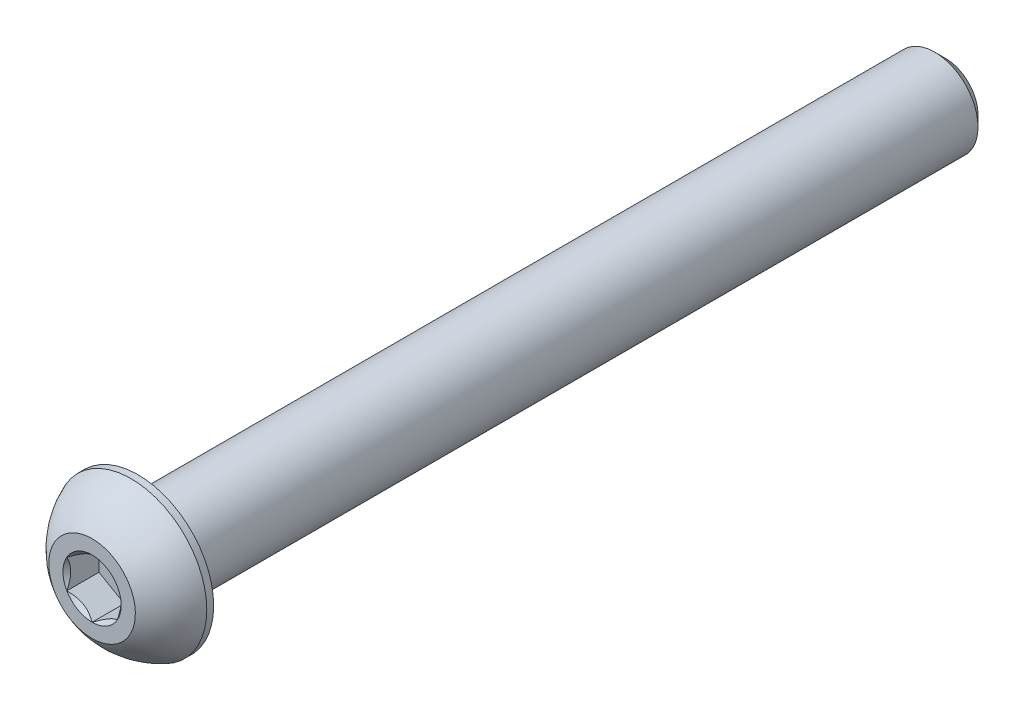
ISO-10303-21;
HEADER;
FILE_DESCRIPTION(('STEP AP214'),'2;1');
FILE_NAME('part.step','',(''),(''),'','','');
FILE_SCHEMA(('AUTOMOTIVE_DESIGN { 1 0 10303 214 1 1 1 1 }'));
ENDSEC;
DATA;
#1=APPLICATION_CONTEXT('core data for automotive mechanical design processes');
#2=APPLICATION_PROTOCOL_DEFINITION('international standard','automotive_design',2000,#1);
#3=PRODUCT_CONTEXT('',#1,'mechanical');
#4=PRODUCT('Part','Part','',(#3));
#5=PRODUCT_RELATED_PRODUCT_CATEGORY('part','',(#4));
#6=PRODUCT_DEFINITION_FORMATION('','',#4);
#7=PRODUCT_DEFINITION_CONTEXT('part definition',#1,'design');
#8=PRODUCT_DEFINITION('design','',#6,#7);
#9=PRODUCT_DEFINITION_SHAPE('','',#8);
#10=(LENGTH_UNIT() NAMED_UNIT(*) SI_UNIT(.MILLI.,.METRE.));
#11=(NAMED_UNIT(*) PLANE_ANGLE_UNIT() SI_UNIT($,.RADIAN.));
#12=(NAMED_UNIT(*) SI_UNIT($,.STERADIAN.) SOLID_ANGLE_UNIT());
#13=UNCERTAINTY_MEASURE_WITH_UNIT(LENGTH_MEASURE(1.E-05),#10,'distance_accuracy_value','');
#14=(GEOMETRIC_REPRESENTATION_CONTEXT(3) GLOBAL_UNCERTAINTY_ASSIGNED_CONTEXT((#13)) GLOBAL_UNIT_ASSIGNED_CONTEXT((#10,
#11,#12)) REPRESENTATION_CONTEXT('',''));
#15=CARTESIAN_POINT('',(0.,0.,0.));
#16=DIRECTION('',(0.,0.,1.));
#17=DIRECTION('',(1.,0.,0.));
#18=AXIS2_PLACEMENT_3D('',#15,#16,#17);
#19=CARTESIAN_POINT('',(-2.22044604925031E-13,-4.7625,-93.9546));
#20=DIRECTION('',(0.,0.,-1.));
#21=DIRECTION('',(0.,1.,0.));
#22=AXIS2_PLACEMENT_3D('',#19,#20,#21);
#23=PLANE('',#22);
#24=CARTESIAN_POINT('',(0.,0.,-93.9546));
#25=DIRECTION('',(0.,0.,-1.));
#26=DIRECTION('',(0.,1.,0.));
#27=AXIS2_PLACEMENT_3D('',#24,#25,#26);
#28=CIRCLE('',#27,3.57187500000002);
#29=CARTESIAN_POINT('',(0.,-3.57187500000001,-93.9546));
#30=VERTEX_POINT('',#29);
#31=EDGE_CURVE('E176',#30,#30,#28,.T.);
#32=ORIENTED_EDGE('',*,*,#31,.T.);
#33=EDGE_LOOP('',(#32));
#34=FACE_BOUND('',#33,.T.);
#35=ADVANCED_FACE('F36',(#34),#23,.T.);
#36=CARTESIAN_POINT('',(0.,0.,-93.9546));
#37=DIRECTION('',(0.,0.,-1.));
#38=DIRECTION('',(0.,1.,0.));
#39=AXIS2_PLACEMENT_3D('',#36,#37,#38);
#40=CYLINDRICAL_SURFACE('',#39,4.7625);
#41=CARTESIAN_POINT('',(0.,0.,-92.763975));
#42=DIRECTION('',(0.,0.,-1.));
#43=DIRECTION('',(0.,1.,0.));
#44=AXIS2_PLACEMENT_3D('',#41,#42,#43);
#45=CIRCLE('',#44,4.7625);
#46=CARTESIAN_POINT('',(0.,-4.76250000000001,-92.763975));
#47=VERTEX_POINT('',#46);
#48=EDGE_CURVE('E50',#47,#47,#45,.F.);
#49=ORIENTED_EDGE('',*,*,#48,.T.);
#50=EDGE_LOOP('',(#49));
#51=FACE_BOUND('',#50,.T.);
#52=CARTESIAN_POINT('',(-2.22044604925031E-13,0.,-5.05460000000002));
#53=DIRECTION('',(0.,0.,1.));
#54=DIRECTION('',(1.,0.,0.));
#55=AXIS2_PLACEMENT_3D('',#52,#53,#54);
#56=CIRCLE('',#55,4.7625);
#57=CARTESIAN_POINT('',(4.76249999999978,0.,-5.05460000000002));
#58=VERTEX_POINT('',#57);
#59=EDGE_CURVE('E173',#58,#58,#56,.F.);
#60=ORIENTED_EDGE('',*,*,#59,.T.);
#61=EDGE_LOOP('',(#60));
#62=FACE_BOUND('',#61,.T.);
#63=ADVANCED_FACE('F181',(#51,#62),#40,.T.);
#64=CARTESIAN_POINT('',(0.,0.,-93.9546));
#65=DIRECTION('',(0.,0.,1.));
#66=DIRECTION('',(0.,-1.,0.));
#67=AXIS2_PLACEMENT_3D('',#64,#65,#66);
#68=CONICAL_SURFACE('',#67,3.57187500000002,0.785398163397448);
#69=CARTESIAN_POINT('',(0.,-4.76250000000001,-92.763975));
#70=CARTESIAN_POINT('',(0.,-4.75009765625001,-92.77637734375));
#71=CARTESIAN_POINT('',(0.,-4.73769531250001,-92.7887796875));
#72=CARTESIAN_POINT('',(0.,-4.71289062500001,-92.813584375));
#73=CARTESIAN_POINT('',(0.,-4.70048828125001,-92.82598671875));
#74=CARTESIAN_POINT('',(0.,-4.67568359375001,-92.85079140625));
#75=CARTESIAN_POINT('',(0.,-4.66328125000001,-92.86319375));
#76=CARTESIAN_POINT('',(0.,-4.63847656250001,-92.8879984375));
#77=CARTESIAN_POINT('',(0.,-4.62607421875001,-92.90040078125));
#78=CARTESIAN_POINT('',(0.,-4.60126953125001,-92.92520546875));
#79=CARTESIAN_POINT('',(0.,-4.58886718750001,-92.9376078125));
#80=CARTESIAN_POINT('',(0.,-4.56406250000001,-92.9624125));
#81=CARTESIAN_POINT('',(0.,-4.55166015625001,-92.97481484375));
#82=CARTESIAN_POINT('',(0.,-4.52685546875001,-92.99961953125));
#83=CARTESIAN_POINT('',(0.,-4.51445312500001,-93.012021875));
#84=CARTESIAN_POINT('',(0.,-4.48964843750001,-93.0368265625));
#85=CARTESIAN_POINT('',(0.,-4.47724609375001,-93.04922890625));
#86=CARTESIAN_POINT('',(0.,-4.45244140625001,-93.07403359375));
#87=CARTESIAN_POINT('',(0.,-4.44003906250001,-93.0864359375));
#88=CARTESIAN_POINT('',(0.,-4.41523437500001,-93.111240625));
#89=CARTESIAN_POINT('',(0.,-4.40283203125001,-93.12364296875));
#90=CARTESIAN_POINT('',(0.,-4.37802734375001,-93.14844765625));
#91=CARTESIAN_POINT('',(0.,-4.36562500000001,-93.16085));
#92=CARTESIAN_POINT('',(0.,-4.34082031250001,-93.1856546875));
#93=CARTESIAN_POINT('',(0.,-4.32841796875001,-93.19805703125));
#94=CARTESIAN_POINT('',(0.,-4.30361328125001,-93.22286171875));
#95=CARTESIAN_POINT('',(0.,-4.29121093750001,-93.2352640625));
#96=CARTESIAN_POINT('',(0.,-4.26640625000001,-93.26006875));
#97=CARTESIAN_POINT('',(0.,-4.25400390625001,-93.27247109375));
#98=CARTESIAN_POINT('',(0.,-4.22919921875001,-93.29727578125));
#99=CARTESIAN_POINT('',(0.,-4.21679687500001,-93.309678125));
#100=CARTESIAN_POINT('',(0.,-4.19199218750001,-93.3344828125));
#101=CARTESIAN_POINT('',(0.,-4.17958984375001,-93.34688515625));
#102=CARTESIAN_POINT('',(0.,-4.15478515625001,-93.37168984375));
#103=CARTESIAN_POINT('',(0.,-4.14238281250001,-93.3840921875));
#104=CARTESIAN_POINT('',(0.,-4.11757812500001,-93.408896875));
#105=CARTESIAN_POINT('',(0.,-4.10517578125001,-93.42129921875));
#106=CARTESIAN_POINT('',(0.,-4.08037109375001,-93.44610390625));
#107=CARTESIAN_POINT('',(0.,-4.06796875000001,-93.45850625));
#108=CARTESIAN_POINT('',(0.,-4.04316406250001,-93.4833109375));
#109=CARTESIAN_POINT('',(0.,-4.03076171875001,-93.49571328125));
#110=CARTESIAN_POINT('',(0.,-4.00595703125001,-93.52051796875));
#111=CARTESIAN_POINT('',(0.,-3.99355468750001,-93.5329203125));
#112=CARTESIAN_POINT('',(0.,-3.96875000000001,-93.557725));
#113=CARTESIAN_POINT('',(0.,-3.95634765625001,-93.57012734375));
#114=CARTESIAN_POINT('',(0.,-3.93154296875001,-93.59493203125));
#115=CARTESIAN_POINT('',(0.,-3.91914062500001,-93.607334375));
#116=CARTESIAN_POINT('',(0.,-3.89433593750001,-93.6321390625));
#117=CARTESIAN_POINT('',(0.,-3.88193359375001,-93.64454140625));
#118=CARTESIAN_POINT('',(0.,-3.85712890625001,-93.66934609375));
#119=CARTESIAN_POINT('',(0.,-3.84472656250001,-93.6817484375));
#120=CARTESIAN_POINT('',(0.,-3.81992187500001,-93.706553125));
#121=CARTESIAN_POINT('',(0.,-3.80751953125001,-93.71895546875));
#122=CARTESIAN_POINT('',(0.,-3.78271484375001,-93.74376015625));
#123=CARTESIAN_POINT('',(0.,-3.77031250000001,-93.7561625));
#124=CARTESIAN_POINT('',(0.,-3.74550781250001,-93.7809671875));
#125=CARTESIAN_POINT('',(0.,-3.73310546875001,-93.79336953125));
#126=CARTESIAN_POINT('',(0.,-3.70830078125001,-93.81817421875));
#127=CARTESIAN_POINT('',(0.,-3.69589843750001,-93.8305765625));
#128=CARTESIAN_POINT('',(0.,-3.67109375000001,-93.85538125));
#129=CARTESIAN_POINT('',(0.,-3.65869140625001,-93.86778359375));
#130=CARTESIAN_POINT('',(0.,-3.63388671875001,-93.89258828125));
#131=CARTESIAN_POINT('',(0.,-3.62148437500001,-93.904990625));
#132=CARTESIAN_POINT('',(0.,-3.59667968750001,-93.9297953125));
#133=CARTESIAN_POINT('',(0.,-3.58427734375001,-93.94219765625));
#134=CARTESIAN_POINT('',(0.,-3.57187500000001,-93.9546));
#135=B_SPLINE_CURVE_WITH_KNOTS('',3,(#69,#70,#71,#72,#73,#74,#75,#76,#77,#78,#79,#80,#81,#82,
#83,#84,#85,#86,#87,#88,#89,#90,#91,#92,#93,#94,#95,#96,#97,#98,#99,#100,#101,#102,#103,#104,
#105,#106,#107,#108,#109,#110,#111,#112,#113,#114,#115,#116,#117,#118,#119,#120,#121,#122,#123,
#124,#125,#126,#127,#128,#129,#130,#131,#132,#133,#134),.UNSPECIFIED.,.F.,.F.,(4,2,2,2,2,2,2,2,
2,2,2,2,2,2,2,2,2,2,2,2,2,2,2,2,2,2,2,2,2,2,2,2,4),(0.,0.0526186882093896,0.105237376418779,
0.157856064628169,0.210474752837558,0.263093441046948,0.315712129256338,0.368330817465727,
0.420949505675117,0.473568193884506,0.526186882093896,0.578805570303285,0.631424258512675,
0.684042946722064,0.736661634931454,0.789280323140843,0.841899011350233,0.894517699559623,
0.947136387769012,0.999755075978402,1.05237376418779,1.10499245239718,1.15761114060657,
1.21022982881596,1.26284851702535,1.31546720523474,1.36808589344413,1.42070458165352,
1.47332326986291,1.5259419580723,1.57856064628169,1.63117933449108,1.68379802270046),.UNSPECIFIED.);
#136=EDGE_CURVE('BSEAM38',#47,#30,#135,.T.);
#137=ORIENTED_EDGE('',*,*,#48,.F.);
#138=ORIENTED_EDGE('',*,*,#31,.F.);
#139=ORIENTED_EDGE('',*,*,#136,.T.);
#140=ORIENTED_EDGE('',*,*,#136,.F.);
#141=EDGE_LOOP('',(#137,#139,#138,#140));
#142=FACE_BOUND('',#141,.T.);
#143=ADVANCED_FACE('F38',(#142),#68,.T.);
#144=CARTESIAN_POINT('',(0.,0.,-7.58617381466153));
#145=DIRECTION('',(0.,0.,1.));
#146=DIRECTION('',(0.,-1.,0.));
#147=AXIS2_PLACEMENT_3D('',#144,#145,#146);
#148=SPHERICAL_SURFACE('',#147,8.9572004217979);
#149=CARTESIAN_POINT('',(0.,0.,0.));
#150=DIRECTION('',(0.,0.,1.));
#151=DIRECTION('',(1.,0.,0.));
#152=AXIS2_PLACEMENT_3D('',#149,#150,#151);
#153=CIRCLE('',#152,4.7625);
#154=CARTESIAN_POINT('',(0.,-4.76249999999999,0.));
#155=VERTEX_POINT('',#154);
#156=EDGE_CURVE('E170',#155,#155,#153,.T.);
#157=CARTESIAN_POINT('',(-2.22044604925031E-13,1.11022302462516E-13,-4.29641000000003));
#158=DIRECTION('',(0.,0.,1.));
#159=DIRECTION('',(1.,0.,0.));
#160=AXIS2_PLACEMENT_3D('',#157,#158,#159);
#161=CIRCLE('',#160,8.3312);
#162=CARTESIAN_POINT('',(0.,-8.33119999999999,-4.29641000000003));
#163=VERTEX_POINT('',#162);
#164=EDGE_CURVE('E164',#163,#163,#161,.T.);
#165=CARTESIAN_POINT('',(0.,-4.76249999999999,0.));
#166=CARTESIAN_POINT('',(0.,-4.81260964553359,-0.0314580778612506));
#167=CARTESIAN_POINT('',(0.,-4.86240751258114,-0.0634127815227664));
#168=CARTESIAN_POINT('',(0.,-4.96136033481777,-0.128302589266068));
#169=CARTESIAN_POINT('',(0.,-5.01051529000685,-0.161237693347853));
#170=CARTESIAN_POINT('',(0.,-5.10816293364022,-0.228075450751433));
#171=CARTESIAN_POINT('',(0.,-5.1566556220845,-0.261978104073228));
#172=CARTESIAN_POINT('',(0.,-5.2529597050362,-0.330737625699055));
#173=CARTESIAN_POINT('',(0.,-5.30077109954361,-0.365594494003088));
#174=CARTESIAN_POINT('',(0.,-5.39569381682617,-0.436248764286399));
#175=CARTESIAN_POINT('',(0.,-5.44280513960131,-0.472046166265677));
#176=CARTESIAN_POINT('',(0.,-5.53630921537568,-0.544567445869759));
#177=CARTESIAN_POINT('',(0.,-5.58270196837493,-0.581291323494563));
#178=CARTESIAN_POINT('',(0.,-5.67475068741133,-0.655651134547841));
#179=CARTESIAN_POINT('',(0.,-5.72040665344849,-0.693287067976315));
#180=CARTESIAN_POINT('',(0.,-5.81096387103531,-0.769456212128977));
#181=CARTESIAN_POINT('',(0.,-5.85586512258496,-0.807989422853164));
#182=CARTESIAN_POINT('',(0.,-5.94489527992949,-0.885937990900432));
#183=CARTESIAN_POINT('',(0.,-5.98902418572437,-0.925353348223513));
#184=CARTESIAN_POINT('',(0.,-6.07649232359194,-1.00505073234356));
#185=CARTESIAN_POINT('',(0.,-6.11983155566463,-1.04533275914052));
#186=CARTESIAN_POINT('',(0.,-6.20570332819268,-1.12674766478091));
#187=CARTESIAN_POINT('',(0.,-6.24823586864803,-1.16788054362433));
#188=CARTESIAN_POINT('',(0.,-6.33247755680934,-1.25098100182578));
#189=CARTESIAN_POINT('',(0.,-6.3741867045153,-1.29294858118381));
#190=CARTESIAN_POINT('',(0.,-6.4567652293646,-1.37770196112389));
#191=CARTESIAN_POINT('',(0.,-6.49763460650793,-1.42048776170594));
#192=CARTESIAN_POINT('',(0.,-6.57851754216922,-1.50686078351465));
#193=CARTESIAN_POINT('',(0.,-6.61853110068717,-1.5504480047413));
#194=CARTESIAN_POINT('',(0.,-6.69768668708676,-1.63840675256829));
#195=CARTESIAN_POINT('',(0.,-6.73682871496841,-1.68277827916862));
#196=CARTESIAN_POINT('',(0.,-6.81422587030594,-1.77228821450102));
#197=CARTESIAN_POINT('',(0.,-6.85248099776184,-1.8174266232331));
#198=CARTESIAN_POINT('',(0.,-6.92808933071513,-1.90845259845764));
#199=CARTESIAN_POINT('',(0.,-6.96544253621252,-1.95434016495011));
#200=CARTESIAN_POINT('',(0.,-7.03923235787118,-2.04684643715442));
#201=CARTESIAN_POINT('',(0.,-7.07566897403246,-2.09346514286626));
#202=CARTESIAN_POINT('',(0.,-7.14761130955581,-2.18741538787392));
#203=CARTESIAN_POINT('',(0.,-7.1831170289179,-2.23474692716974));
#204=CARTESIAN_POINT('',(0.,-7.25318362891244,-2.33010425380361));
#205=CARTESIAN_POINT('',(0.,-7.28774450954489,-2.37813004114167));
#206=CARTESIAN_POINT('',(0.,-7.35590786115682,-2.47485700570989));
#207=CARTESIAN_POINT('',(0.,-7.3895103321363,-2.52355818294005));
#208=CARTESIAN_POINT('',(0.,-7.45574366985515,-2.62161680393882));
#209=CARTESIAN_POINT('',(0.,-7.48837453659453,-2.67097424770742));
#210=CARTESIAN_POINT('',(0.,-7.55265185276235,-2.7703260207354));
#211=CARTESIAN_POINT('',(0.,-7.58429830219079,-2.82032034999478));
#212=CARTESIAN_POINT('',(0.,-7.64659435721727,-2.92092626287139));
#213=CARTESIAN_POINT('',(0.,-7.67724396281532,-2.97153784648862));
#214=CARTESIAN_POINT('',(0.,-7.73753429507813,-3.07335839457716));
#215=CARTESIAN_POINT('',(0.,-7.76717502174289,-3.12456735904847));
#216=CARTESIAN_POINT('',(0.,-7.825435957232,-3.22756256075199));
#217=CARTESIAN_POINT('',(0.,-7.85405616605635,-3.2793487979842));
#218=CARTESIAN_POINT('',(0.,-7.91026482752416,-3.38347821050592));
#219=CARTESIAN_POINT('',(0.,-7.93785328016762,-3.43582138579544));
#220=CARTESIAN_POINT('',(0.,-7.99198759665663,-3.54104412079174));
#221=CARTESIAN_POINT('',(0.,-8.01853346050219,-3.59392368049851));
#222=CARTESIAN_POINT('',(0.,-8.07057217397927,-3.70019842098383));
#223=CARTESIAN_POINT('',(0.,-8.09606502361079,-3.75359360176237));
#224=CARTESIAN_POINT('',(0.,-8.14598770489916,-3.86087861516294));
#225=CARTESIAN_POINT('',(0.,-8.17041753655602,-3.91476844778496));
#226=CARTESIAN_POINT('',(0.,-8.21820456505067,-4.02302161415685));
#227=CARTESIAN_POINT('',(0.,-8.24156176188846,-4.07738494790672));
#228=CARTESIAN_POINT('',(0.,-8.28719443890176,-4.1865637323209));
#229=CARTESIAN_POINT('',(0.,-8.30946991907726,-4.2413791829852));
#230=CARTESIAN_POINT('',(0.,-8.33119999999999,-4.29641000000003));
#231=B_SPLINE_CURVE_WITH_KNOTS('',3,(#165,#166,#167,#168,#169,#170,#171,#172,#173,#174,#175,
#176,#177,#178,#179,#180,#181,#182,#183,#184,#185,#186,#187,#188,#189,#190,#191,#192,#193,#194,
#195,#196,#197,#198,#199,#200,#201,#202,#203,#204,#205,#206,#207,#208,#209,#210,#211,#212,#213,
#214,#215,#216,#217,#218,#219,#220,#221,#222,#223,#224,#225,#226,#227,#228,#229,#230),
.UNSPECIFIED.,.F.,.F.,(4,2,2,2,2,2,2,2,2,2,2,2,2,2,2,2,2,2,2,2,2,2,2,2,2,2,2,2,2,2,2,2,4),(0.,
0.177494373175661,0.354988746351323,0.532483119526984,0.709977492702646,0.887471865878307,
1.06496623905397,1.24246061222963,1.41995498540529,1.59744935858095,1.77494373175662,
1.95243810493228,2.12993247810794,2.3074268512836,2.48492122445926,2.66241559763492,
2.83990997081058,3.01740434398625,3.19489871716191,3.37239309033757,3.54988746351323,
3.72738183668889,3.90487620986455,4.08237058304022,4.25986495621588,4.43735932939154,
4.6148537025672,4.79234807574286,4.96984244891852,5.14733682209418,5.32483119526984,
5.5023255684455,5.67981994162117),.UNSPECIFIED.);
#232=EDGE_CURVE('BSEAM186',#155,#163,#231,.T.);
#233=ORIENTED_EDGE('',*,*,#156,.F.);
#234=ORIENTED_EDGE('',*,*,#164,.T.);
#235=ORIENTED_EDGE('',*,*,#232,.T.);
#236=ORIENTED_EDGE('',*,*,#232,.F.);
#237=EDGE_LOOP('',(#233,#235,#234,#236));
#238=FACE_BOUND('',#237,.T.);
#239=ADVANCED_FACE('F186',(#238),#148,.T.);
#240=CARTESIAN_POINT('',(0.,-4.76249999999989,1.11022302462516E-13));
#241=DIRECTION('',(0.,0.,-1.));
#242=DIRECTION('',(-1.,0.,0.));
#243=AXIS2_PLACEMENT_3D('',#240,#241,#242);
#244=PLANE('',#243);
#245=CARTESIAN_POINT('',(0.,0.,0.));
#246=DIRECTION('',(0.,0.,1.));
#247=DIRECTION('',(1.,0.,0.));
#248=AXIS2_PLACEMENT_3D('',#245,#246,#247);
#249=CIRCLE('',#248,3.20790243318486);
#250=CARTESIAN_POINT('',(-2.77812499999985,1.60395121659251,0.));
#251=VERTEX_POINT('',#250);
#252=CARTESIAN_POINT('',(-2.77812499999985,-1.6039512165924,-1.11022302462516E-13));
#253=VERTEX_POINT('',#252);
#254=EDGE_CURVE('E63',#251,#253,#249,.T.);
#255=ORIENTED_EDGE('',*,*,#254,.F.);
#256=CARTESIAN_POINT('',(2.22044604925031E-13,3.20790243318492,1.11022302462516E-13));
#257=VERTEX_POINT('',#256);
#258=EDGE_CURVE('E135',#257,#251,#249,.T.);
#259=ORIENTED_EDGE('',*,*,#258,.F.);
#260=CARTESIAN_POINT('',(2.77812500000008,1.60395121659251,3.33066907387547E-13));
#261=VERTEX_POINT('',#260);
#262=EDGE_CURVE('E132',#261,#257,#249,.T.);
#263=ORIENTED_EDGE('',*,*,#262,.F.);
#264=CARTESIAN_POINT('',(2.7781250000003,-1.60395121659229,2.22044604925031E-13));
#265=VERTEX_POINT('',#264);
#266=EDGE_CURVE('E103',#265,#261,#249,.T.);
#267=ORIENTED_EDGE('',*,*,#266,.F.);
#268=CARTESIAN_POINT('',(0.,-3.2079024331847,0.));
#269=VERTEX_POINT('',#268);
#270=EDGE_CURVE('E95',#269,#265,#249,.T.);
#271=ORIENTED_EDGE('',*,*,#270,.F.);
#272=EDGE_CURVE('E56',#253,#269,#249,.T.);
#273=ORIENTED_EDGE('',*,*,#272,.F.);
#274=EDGE_LOOP('',(#255,#259,#263,#267,#271,#273));
#275=FACE_BOUND('',#274,.T.);
#276=ORIENTED_EDGE('',*,*,#156,.T.);
#277=EDGE_LOOP('',(#276));
#278=FACE_BOUND('',#277,.T.);
#279=ADVANCED_FACE('F129',(#275,#278),#244,.F.);
#280=CARTESIAN_POINT('',(-2.22044604925031E-13,-8.33119999999987,-5.05460000000002));
#281=DIRECTION('',(0.,0.,1.));
#282=DIRECTION('',(1.,0.,0.));
#283=AXIS2_PLACEMENT_3D('',#280,#281,#282);
#284=PLANE('',#283);
#285=ORIENTED_EDGE('',*,*,#59,.F.);
#286=EDGE_LOOP('',(#285));
#287=FACE_BOUND('',#286,.T.);
#288=CARTESIAN_POINT('',(-2.22044604925031E-13,0.,-5.05460000000002));
#289=DIRECTION('',(0.,0.,1.));
#290=DIRECTION('',(1.,0.,0.));
#291=AXIS2_PLACEMENT_3D('',#288,#289,#290);
#292=CIRCLE('',#291,8.3312);
#293=CARTESIAN_POINT('',(8.33119999999978,0.,-5.05460000000002));
#294=VERTEX_POINT('',#293);
#295=EDGE_CURVE('E167',#294,#294,#292,.T.);
#296=ORIENTED_EDGE('',*,*,#295,.F.);
#297=EDGE_LOOP('',(#296));
#298=FACE_BOUND('',#297,.T.);
#299=ADVANCED_FACE('F200',(#287,#298),#284,.F.);
#300=CARTESIAN_POINT('',(0.,0.,0.));
#301=DIRECTION('',(0.,0.,1.));
#302=DIRECTION('',(1.,0.,0.));
#303=AXIS2_PLACEMENT_3D('',#300,#301,#302);
#304=CYLINDRICAL_SURFACE('',#303,8.3312);
#305=ORIENTED_EDGE('',*,*,#164,.F.);
#306=EDGE_LOOP('',(#305));
#307=FACE_BOUND('',#306,.T.);
#308=ORIENTED_EDGE('',*,*,#295,.T.);
#309=EDGE_LOOP('',(#308));
#310=FACE_BOUND('',#309,.T.);
#311=ADVANCED_FACE('F203',(#307,#310),#304,.T.);
#312=CARTESIAN_POINT('',(0.,0.,0.));
#313=DIRECTION('',(0.,0.,1.));
#314=DIRECTION('',(1.,0.,0.));
#315=AXIS2_PLACEMENT_3D('',#312,#313,#314);
#316=CONICAL_SURFACE('',#315,3.20790243318486,0.78539816339745);
#317=ORIENTED_EDGE('',*,*,#266,.T.);
#318=CARTESIAN_POINT('',(2.77812500000008,-3.1989333906749,1.02897771069488));
#319=CARTESIAN_POINT('',(2.77812499999993,-3.12104287934492,0.970182112833157));
#320=CARTESIAN_POINT('',(2.77812499999987,-3.04271626337415,0.91195485244054));
#321=CARTESIAN_POINT('',(2.77812499999983,-2.8850187927723,0.796891469853639));
#322=CARTESIAN_POINT('',(2.77812499999985,-2.80564768093979,0.740055700548902));
#323=CARTESIAN_POINT('',(2.77812499999986,-2.64510859117426,0.627625663638833));
#324=CARTESIAN_POINT('',(2.77812499999985,-2.56393145572803,0.572044427731417));
#325=CARTESIAN_POINT('',(2.77812499999985,-2.40019929215903,0.462956578017707));
#326=CARTESIAN_POINT('',(2.77812499999986,-2.31764436197581,0.409449817639769));
#327=CARTESIAN_POINT('',(2.77812499999985,-2.14616017979617,0.301978364366588));
#328=CARTESIAN_POINT('',(2.77812499999984,-2.05713676020385,0.248163163943326));
#329=CARTESIAN_POINT('',(2.77812499999986,-1.87703774093302,0.144089186479514));
#330=CARTESIAN_POINT('',(2.77812499999989,-1.78596241400882,0.093829940390521));
#331=CARTESIAN_POINT('',(2.77812499999982,-1.60172984286449,-0.00207206480536181));
#332=CARTESIAN_POINT('',(2.77812499999973,-1.50857939264594,-0.0477277732967751));
#333=CARTESIAN_POINT('',(2.77812499999998,-1.31973803298642,-0.133392376231578));
#334=CARTESIAN_POINT('',(2.77812500000032,-1.22404829730506,-0.173403827462003));
#335=CARTESIAN_POINT('',(2.77812500000028,-1.03779113415397,-0.243419596624692));
#336=CARTESIAN_POINT('',(2.77812499999996,-0.947431177162325,-0.273970108451989));
#337=CARTESIAN_POINT('',(2.77812499999975,-0.764535760780983,-0.327821956565668));
#338=CARTESIAN_POINT('',(2.77812499999986,-0.672000151991243,-0.351122793450449));
#339=CARTESIAN_POINT('',(2.77812499999985,-0.486845055426749,-0.388870830511001));
#340=CARTESIAN_POINT('',(2.77812499999974,-0.394257006574122,-0.403469723559201));
#341=CARTESIAN_POINT('',(2.77812499999997,-0.208091161986042,-0.423530496457445));
#342=CARTESIAN_POINT('',(2.7781250000003,-0.114513539170314,-0.428993946942506));
#343=CARTESIAN_POINT('',(2.77812500000029,0.0693219370915118,-0.430378152359769));
#344=CARTESIAN_POINT('',(2.77812499999997,0.159577353029267,-0.426637154425417));
#345=CARTESIAN_POINT('',(2.77812499999974,0.339314453776453,-0.410565100499051));
#346=CARTESIAN_POINT('',(2.77812499999983,0.428796062566571,-0.398233210023708));
#347=CARTESIAN_POINT('',(2.77812499999987,0.607853741349527,-0.365443365234272));
#348=CARTESIAN_POINT('',(2.77812499999982,0.697404117826956,-0.344847126319593));
#349=CARTESIAN_POINT('',(2.77812499999989,0.874544782985422,-0.296623371143805));
#350=CARTESIAN_POINT('',(2.77812500000002,0.962135235007627,-0.268996443216446));
#351=CARTESIAN_POINT('',(2.77812500000019,1.23792450105834,-0.171622660041122));
#352=CARTESIAN_POINT('',(2.77812499999991,1.42222250546998,-0.0907854186578278));
#353=CARTESIAN_POINT('',(2.77812499999982,1.6919116692676,0.0439414309000117));
#354=CARTESIAN_POINT('',(2.77812499999984,1.7808500546354,0.0912018998494886));
#355=CARTESIAN_POINT('',(2.77812499999986,1.956705549028,0.189353137107481));
#356=CARTESIAN_POINT('',(2.77812499999986,2.04362301855738,0.240243251244116));
#357=CARTESIAN_POINT('',(2.77812499999985,2.21139510700121,0.342314648803786));
#358=CARTESIAN_POINT('',(2.77812499999985,2.29233619472013,0.393355424408316));
#359=CARTESIAN_POINT('',(2.77812499999986,2.45283061736795,0.497584684681159));
#360=CARTESIAN_POINT('',(2.77812499999986,2.53238384652644,0.550773332026333));
#361=CARTESIAN_POINT('',(2.77812499999985,2.68963703454154,0.658473672033045));
#362=CARTESIAN_POINT('',(2.77812499999983,2.76734679840964,0.712971107779668));
#363=CARTESIAN_POINT('',(2.77812499999987,2.92170433307709,0.823407173708449));
#364=CARTESIAN_POINT('',(2.77812499999993,2.99835239004638,0.879345403442704));
#365=CARTESIAN_POINT('',(2.77812500000008,3.0745560857186,0.935872855106545));
#366=B_SPLINE_CURVE_WITH_KNOTS('',3,(#318,#319,#320,#321,#322,#323,#324,#325,#326,#327,#328,
#329,#330,#331,#332,#333,#334,#335,#336,#337,#338,#339,#340,#341,#342,#343,#344,#345,#346,#347,
#348,#349,#350,#351,#352,#353,#354,#355,#356,#357,#358,#359,#360,#361,#362,#363,#364,#365),
.UNSPECIFIED.,.F.,.F.,(4,2,2,2,2,2,2,2,2,2,2,2,2,2,2,2,2,2,2,2,2,2,2,4),(0.,0.292776498067434,
0.585626492410769,0.880745572137528,1.17584376214477,1.48785387597866,1.79982275706812,
2.11088806424758,2.42181200660905,2.70771495231946,2.99363758840138,3.27441800895733,
3.55515015063471,3.82572098330863,4.0963181017656,4.37164557500352,4.64695001618708,
5.24881162882165,5.55093378415077,5.85300162485642,6.14003787153105,6.42709589886198,
6.7118221191311,6.99647004006443),.UNSPECIFIED.);
#367=EDGE_CURVE('E11',#265,#261,#366,.T.);
#368=ORIENTED_EDGE('',*,*,#367,.F.);
#369=EDGE_LOOP('',(#317,#368));
#370=FACE_BOUND('',#369,.T.);
#371=ADVANCED_FACE('F107',(#370),#316,.F.);
#372=ORIENTED_EDGE('',*,*,#262,.T.);
#373=CARTESIAN_POINT('',(2.77832499999997,1.60383574653866,0.000115476288531369));
#374=CARTESIAN_POINT('',(2.68282743030512,1.6589712941088,-0.0549730585164607));
#375=CARTESIAN_POINT('',(2.58573301735403,1.71502877956289,-0.10682615961742));
#376=CARTESIAN_POINT('',(2.38774683834102,1.82933615331188,-0.201767944367315));
#377=CARTESIAN_POINT('',(2.28683624347535,1.8875969124217,-0.244803802888726));
#378=CARTESIAN_POINT('',(2.08335484845562,2.00507695061135,-0.318525062571888));
#379=CARTESIAN_POINT('',(1.98083586921721,2.0642663108716,-0.34939575854891));
#380=CARTESIAN_POINT('',(1.77354099330505,2.18394806328137,-0.39695846186228));
#381=CARTESIAN_POINT('',(1.66877142911046,2.24443679937234,-0.413685973168943));
#382=CARTESIAN_POINT('',(1.48820620685349,2.34868617904856,-0.428778529591004));
#383=CARTESIAN_POINT('',(1.41264381636984,2.39231214553465,-0.43101268975091));
#384=CARTESIAN_POINT('',(1.26164255832217,2.47949276251626,-0.427248593219776));
#385=CARTESIAN_POINT('',(1.18620374334295,2.52304738265195,-0.421247450458864));
#386=CARTESIAN_POINT('',(1.03603843948392,2.60974536125791,-0.401354250985725));
#387=CARTESIAN_POINT('',(0.961312842655897,2.65288820470185,-0.387453367409264));
#388=CARTESIAN_POINT('',(0.81315383791857,2.73842784596996,-0.352523739106758));
#389=CARTESIAN_POINT('',(0.73972033139907,2.78082470072676,-0.331495540829338));
#390=CARTESIAN_POINT('',(0.551630036055924,2.88941868337523,-0.269070235989197));
#391=CARTESIAN_POINT('',(0.438139373422347,2.95494254799689,-0.22296815366679));
#392=CARTESIAN_POINT('',(0.27126118075109,3.05128971745736,-0.145141753603738));
#393=CARTESIAN_POINT('',(0.216267345914626,3.08304042280396,-0.117797173342992));
#394=CARTESIAN_POINT('',(0.107298308842374,3.14595372569106,-0.0606153843429848));
#395=CARTESIAN_POINT('',(0.0533225059624799,3.17711667001358,-0.0307797055956049));
#396=CARTESIAN_POINT('',(-0.000199999999672684,3.20801790323866,0.000115476288309324));
#397=B_SPLINE_CURVE_WITH_KNOTS('',3,(#373,#374,#375,#376,#377,#378,#379,#380,#381,#382,#383,
#384,#385,#386,#387,#388,#389,#390,#391,#392,#393,#394,#395,#396),.UNSPECIFIED.,.F.,.F.,(4,2,2,
2,2,2,2,2,2,2,2,4),(0.,0.37005359137985,0.742263257937896,1.10856148626466,1.47393743409698,
1.73540843293428,1.99697108794064,2.25882657917959,2.52066199859294,2.93655069655312,
3.1439311494816,3.35118515668731),.UNSPECIFIED.);
#398=EDGE_CURVE('E134',#261,#257,#397,.T.);
#399=ORIENTED_EDGE('',*,*,#398,.F.);
#400=EDGE_LOOP('',(#372,#399));
#401=FACE_BOUND('',#400,.T.);
#402=ADVANCED_FACE('F288',(#401),#316,.F.);
#403=ORIENTED_EDGE('',*,*,#258,.T.);
#404=CARTESIAN_POINT('',(0.000200000000116773,3.20801790323877,0.000115476288309324));
#405=CARTESIAN_POINT('',(-0.0952975696947839,3.1528823556685,-0.0549730585164639));
#406=CARTESIAN_POINT('',(-0.192391982645902,3.09682487021438,-0.106826159617318));
#407=CARTESIAN_POINT('',(-0.390378161658931,2.98251749646538,-0.201767944367117));
#408=CARTESIAN_POINT('',(-0.491288756524592,2.9242567373556,-0.244803802888539));
#409=CARTESIAN_POINT('',(-0.694770151544267,2.80677669916592,-0.318525062571749));
#410=CARTESIAN_POINT('',(-0.797289130782633,2.74758733890562,-0.349395758548805));
#411=CARTESIAN_POINT('',(-1.0045840066949,2.62790558649601,-0.39695846186206));
#412=CARTESIAN_POINT('',(-1.10935357088964,2.56741685040525,-0.413685973168575));
#413=CARTESIAN_POINT('',(-1.28991879314657,2.46316747072894,-0.428778529590696));
#414=CARTESIAN_POINT('',(-1.36548118363013,2.41954150424268,-0.431012689750721));
#415=CARTESIAN_POINT('',(-1.51648244167774,2.33236088726094,-0.427248593219672));
#416=CARTESIAN_POINT('',(-1.591921256657,2.28880626712531,-0.421247450458726));
#417=CARTESIAN_POINT('',(-1.74208656051605,2.20210828851935,-0.401354250985575));
#418=CARTESIAN_POINT('',(-1.81681215734405,2.15896544507537,-0.387453367409137));
#419=CARTESIAN_POINT('',(-1.96497116208142,2.07342580380733,-0.352523739106601));
#420=CARTESIAN_POINT('',(-2.03840466860098,2.03102894905065,-0.331495540829128));
#421=CARTESIAN_POINT('',(-2.2264949639442,1.92243496640224,-0.269070235988953));
#422=CARTESIAN_POINT('',(-2.33998562657772,1.85691110178039,-0.222968153666625));
#423=CARTESIAN_POINT('',(-2.50686381924895,1.76056393231982,-0.145141753603569));
#424=CARTESIAN_POINT('',(-2.56185765408541,1.72881322697321,-0.1177971733428));
#425=CARTESIAN_POINT('',(-2.67082669115773,1.66589992408615,-0.0606153843428129));
#426=CARTESIAN_POINT('',(-2.7248024940377,1.63473697976367,-0.0307797055954757));
#427=CARTESIAN_POINT('',(-2.77832499999997,1.60383574653866,0.000115476288309324));
#428=B_SPLINE_CURVE_WITH_KNOTS('',3,(#404,#405,#406,#407,#408,#409,#410,#411,#412,#413,#414,
#415,#416,#417,#418,#419,#420,#421,#422,#423,#424,#425,#426,#427),.UNSPECIFIED.,.F.,.F.,(4,2,2,
2,2,2,2,2,2,2,2,4),(0.,0.370053591379846,0.742263257937842,1.1085614862646,1.47393743409692,
1.73540843293425,1.99697108794063,2.25882657917958,2.52066199859296,2.9365506965532,
3.14393114948172,3.35118515668747),.UNSPECIFIED.);
#429=EDGE_CURVE('E139',#257,#251,#428,.T.);
#430=ORIENTED_EDGE('',*,*,#429,.F.);
#431=EDGE_LOOP('',(#403,#430));
#432=FACE_BOUND('',#431,.T.);
#433=ADVANCED_FACE('F142',(#432),#316,.F.);
#434=ORIENTED_EDGE('',*,*,#254,.T.);
#435=CARTESIAN_POINT('',(-2.77812499999985,-3.19893339020949,1.02897771034338));
#436=CARTESIAN_POINT('',(-2.77812499999985,-3.12104287889255,0.970182112495241));
#437=CARTESIAN_POINT('',(-2.77812499999985,-3.04271626293487,0.91195485211616));
#438=CARTESIAN_POINT('',(-2.77812499999985,-2.88501879235935,0.796891469556231));
#439=CARTESIAN_POINT('',(-2.77812499999985,-2.80564768054008,0.740055700264928));
#440=CARTESIAN_POINT('',(-2.77812499999985,-2.64510859080146,0.627625663381819));
#441=CARTESIAN_POINT('',(-2.77812499999985,-2.5639314553689,0.572044427487925));
#442=CARTESIAN_POINT('',(-2.77812499999985,-2.4001992918275,0.46295657780104));
#443=CARTESIAN_POINT('',(-2.77812499999985,-2.3176443616582,0.409449817436408));
#444=CARTESIAN_POINT('',(-2.77812499999985,-2.14616017950858,0.301978364190911));
#445=CARTESIAN_POINT('',(-2.77812499999985,-2.05713675993241,0.248163163781976));
#446=CARTESIAN_POINT('',(-2.77812499999985,-1.87703774069443,0.14408918634613));
#447=CARTESIAN_POINT('',(-2.77812499999985,-1.78596241378695,0.0938299402707764));
#448=CARTESIAN_POINT('',(-2.77812499999985,-1.60172984267665,-0.00207206489890577));
#449=CARTESIAN_POINT('',(-2.77812499999985,-1.50857939247541,-0.0477277733777505));
#450=CARTESIAN_POINT('',(-2.77812499999985,-1.31973803285151,-0.133392376289163));
#451=CARTESIAN_POINT('',(-2.77812499999985,-1.22404829718846,-0.173403827508765));
#452=CARTESIAN_POINT('',(-2.77812499999985,-1.03779113404527,-0.24341959666325));
#453=CARTESIAN_POINT('',(-2.77812499999985,-0.947431177042407,-0.273970108491118));
#454=CARTESIAN_POINT('',(-2.77812499999985,-0.764535760638333,-0.327821956603853));
#455=CARTESIAN_POINT('',(-2.77812499999985,-0.67200015183707,-0.351122793487121));
#456=CARTESIAN_POINT('',(-2.77812499999985,-0.486845055249893,-0.388870830541918));
#457=CARTESIAN_POINT('',(-2.77812499999985,-0.394257006386113,-0.403469723585948));
#458=CARTESIAN_POINT('',(-2.77812499999985,-0.208091161776122,-0.423530496473586));
#459=CARTESIAN_POINT('',(-2.77812499999985,-0.114513538949638,-0.428993946952214));
#460=CARTESIAN_POINT('',(-2.77812499999985,0.0693219373320375,-0.430378152354333));
#461=CARTESIAN_POINT('',(-2.77812499999985,0.159577353278914,-0.426637154411412));
#462=CARTESIAN_POINT('',(-2.77812499999986,0.339314454043448,-0.410565100466853));
#463=CARTESIAN_POINT('',(-2.77812499999987,0.428796062841792,-0.398233209981884));
#464=CARTESIAN_POINT('',(-2.77812499999984,0.607853741640975,-0.365443365172164));
#465=CARTESIAN_POINT('',(-2.77812499999981,0.697404118126382,-0.344847126246764));
#466=CARTESIAN_POINT('',(-2.7781249999999,0.874544783300068,-0.296623371049465));
#467=CARTESIAN_POINT('',(-2.77812500000003,0.962135235329518,-0.268996443111318));
#468=CARTESIAN_POINT('',(-2.77812500000018,1.23792450145032,-0.171622659884729));
#469=CARTESIAN_POINT('',(-2.77812499999991,1.42222250592122,-0.0907854184538879));
#470=CARTESIAN_POINT('',(-2.77812499999982,1.69191166980426,0.0439414311788398));
#471=CARTESIAN_POINT('',(-2.77812499999985,1.78085005520007,0.0912019001539612));
#472=CARTESIAN_POINT('',(-2.77812499999986,1.95670554964775,0.189353137464091));
#473=CARTESIAN_POINT('',(-2.77812499999986,2.04362301920423,0.240243251627218));
#474=CARTESIAN_POINT('',(-2.77812499999985,2.2113951076973,0.342314649237187));
#475=CARTESIAN_POINT('',(-2.77812499999985,2.29233619543845,0.393355424865408));
#476=CARTESIAN_POINT('',(-2.77812499999985,2.45283061813043,0.497584685185734));
#477=CARTESIAN_POINT('',(-2.77812499999985,2.53238384731085,0.550773332554701));
#478=CARTESIAN_POINT('',(-2.77812499999985,2.68963703536925,0.658473672608731));
#479=CARTESIAN_POINT('',(-2.77812499999985,2.76734679925873,0.712971108378876));
#480=CARTESIAN_POINT('',(-2.77812499999985,2.92170433396881,0.823407174354627));
#481=CARTESIAN_POINT('',(-2.77812499999985,2.99835239095937,0.879345404112332));
#482=CARTESIAN_POINT('',(-2.77812499999985,3.07455608665286,0.935872855799547));
#483=B_SPLINE_CURVE_WITH_KNOTS('',3,(#435,#436,#437,#438,#439,#440,#441,#442,#443,#444,#445,
#446,#447,#448,#449,#450,#451,#452,#453,#454,#455,#456,#457,#458,#459,#460,#461,#462,#463,#464,
#465,#466,#467,#468,#469,#470,#471,#472,#473,#474,#475,#476,#477,#478,#479,#480,#481,#482),
.UNSPECIFIED.,.F.,.F.,(4,2,2,2,2,2,2,2,2,2,2,2,2,2,2,2,2,2,2,2,2,2,2,4),(0.,0.292776498011686,
0.585626492299261,0.880745571969262,1.17584376191974,1.48785387568997,1.79982275671578,
2.11088806383206,2.42181200613045,2.70771495187313,2.99363758798729,3.27441800857417,
3.55515015028245,3.82572098298464,4.09631810146995,4.37164557473839,4.64695001595242,
5.24881162880602,5.55093378424546,5.85300162506137,6.14003787183035,6.42709589925564,
6.71182211961779,6.99647004064412),.UNSPECIFIED.);
#484=EDGE_CURVE('E146',#251,#253,#483,.F.);
#485=ORIENTED_EDGE('',*,*,#484,.F.);
#486=EDGE_LOOP('',(#434,#485));
#487=FACE_BOUND('',#486,.T.);
#488=ADVANCED_FACE('F282',(#487),#316,.F.);
#489=ORIENTED_EDGE('',*,*,#272,.T.);
#490=CARTESIAN_POINT('',(-2.77832499999975,-1.60383574653855,0.000115476288198302));
#491=CARTESIAN_POINT('',(-2.68282743030493,-1.65897129410888,-0.0549730585166606));
#492=CARTESIAN_POINT('',(-2.58573301735385,-1.71502877956301,-0.106826159617541));
#493=CARTESIAN_POINT('',(-2.38774683834084,-1.82933615331201,-0.201767944367347));
#494=CARTESIAN_POINT('',(-2.28683624347517,-1.88759691242177,-0.244803802888749));
#495=CARTESIAN_POINT('',(-2.0833548484555,-2.00507695061148,-0.318525062571949));
#496=CARTESIAN_POINT('',(-1.98083586921713,-2.06426631087182,-0.349395758549012));
#497=CARTESIAN_POINT('',(-1.7735409933048,-2.18394806328137,-0.396958461862227));
#498=CARTESIAN_POINT('',(-1.66877142910999,-2.24443679937204,-0.413685973168693));
#499=CARTESIAN_POINT('',(-1.48820620685309,-2.34868617904838,-0.4287785295908));
#500=CARTESIAN_POINT('',(-1.41264381636959,-2.3923121455347,-0.431012689750841));
#501=CARTESIAN_POINT('',(-1.26164255832204,-2.47949276251647,-0.427248593219804));
#502=CARTESIAN_POINT('',(-1.18620374334279,-2.52304738265207,-0.421247450458854));
#503=CARTESIAN_POINT('',(-1.03603843948379,-2.609745361258,-0.401354250985663));
#504=CARTESIAN_POINT('',(-0.961312842655824,-2.65288820470198,-0.387453367409189));
#505=CARTESIAN_POINT('',(-0.813153837918459,-2.73842784596997,-0.352523739106756));
#506=CARTESIAN_POINT('',(-0.739720331398859,-2.78082470072659,-0.331495540829422));
#507=CARTESIAN_POINT('',(-0.551630036055631,-2.88941868337495,-0.269070235989333));
#508=CARTESIAN_POINT('',(-0.438139373422211,-2.95494254799687,-0.222968153666793));
#509=CARTESIAN_POINT('',(-0.271261180751015,-3.05128971745748,-0.145141753603644));
#510=CARTESIAN_POINT('',(-0.216267345914539,-3.08304042280409,-0.117797173342879));
#511=CARTESIAN_POINT('',(-0.10729830884218,-3.14595372569113,-0.0606153843429149));
#512=CARTESIAN_POINT('',(-0.0533225059621906,-3.17711667001358,-0.0307797055955957));
#513=CARTESIAN_POINT('',(0.000200000000116773,-3.20801790323855,0.000115476288198302));
#514=B_SPLINE_CURVE_WITH_KNOTS('',3,(#490,#491,#492,#493,#494,#495,#496,#497,#498,#499,#500,
#501,#502,#503,#504,#505,#506,#507,#508,#509,#510,#511,#512,#513),.UNSPECIFIED.,.F.,.F.,(4,2,2,
2,2,2,2,2,2,2,2,4),(0.,0.370053591379824,0.742263257937798,1.10856148626459,1.47393743409695,
1.73540843293421,1.99697108794053,2.25882657917941,2.5206619985927,2.93655069655296,
3.14393114948151,3.35118515668727),.UNSPECIFIED.);
#515=EDGE_CURVE('E119',#253,#269,#514,.T.);
#516=ORIENTED_EDGE('',*,*,#515,.F.);
#517=EDGE_LOOP('',(#489,#516));
#518=FACE_BOUND('',#517,.T.);
#519=ADVANCED_FACE('F230',(#518),#316,.F.);
#520=ORIENTED_EDGE('',*,*,#270,.T.);
#521=CARTESIAN_POINT('',(-0.000199999999894729,-3.20801790323855,0.000115476288198302));
#522=CARTESIAN_POINT('',(0.0952975696949692,-3.15288235566826,-0.054973058516617));
#523=CARTESIAN_POINT('',(0.192391982646079,-3.09682487021414,-0.106826159617511));
#524=CARTESIAN_POINT('',(0.390378161659142,-2.98251749646514,-0.201767944367364));
#525=CARTESIAN_POINT('',(0.491288756524844,-2.92425673735534,-0.244803802888798));
#526=CARTESIAN_POINT('',(0.69477015154458,-2.8067766991656,-0.318525062571946));
#527=CARTESIAN_POINT('',(0.797289130782964,-2.74758733890524,-0.349395758548931));
#528=CARTESIAN_POINT('',(1.00458400669531,-2.6279055864957,-0.396958461862346));
#529=CARTESIAN_POINT('',(1.10935357089009,-2.56741685040506,-0.413685973169093));
#530=CARTESIAN_POINT('',(1.28991879314698,-2.46316747072872,-0.428778529591084));
#531=CARTESIAN_POINT('',(1.36548118363047,-2.41954150424239,-0.4310126897509));
#532=CARTESIAN_POINT('',(1.51648244167801,-2.33236088726062,-0.427248593219697));
#533=CARTESIAN_POINT('',(1.59192125665727,-2.28880626712502,-0.421247450458804));
#534=CARTESIAN_POINT('',(1.74208656051627,-2.2021082885191,-0.40135425098564));
#535=CARTESIAN_POINT('',(1.81681215734423,-2.15896544507511,-0.387453367409135));
#536=CARTESIAN_POINT('',(1.96497116208161,-2.07342580380713,-0.35252373910671));
#537=CARTESIAN_POINT('',(2.03840466860122,-2.03102894905051,-0.331495540829415));
#538=CARTESIAN_POINT('',(2.22649496394447,-1.92243496640214,-0.269070235989336));
#539=CARTESIAN_POINT('',(2.33998562657788,-1.8569111017802,-0.222968153666716));
#540=CARTESIAN_POINT('',(2.5068638192491,-1.76056393231958,-0.145141753603528));
#541=CARTESIAN_POINT('',(2.56185765408559,-1.72881322697296,-0.117797173342765));
#542=CARTESIAN_POINT('',(2.67082669115795,-1.66589992408591,-0.0606153843427788));
#543=CARTESIAN_POINT('',(2.72480249403793,-1.63473697976344,-0.0307797055954364));
#544=CARTESIAN_POINT('',(2.77832500000019,-1.60383574653844,0.000115476288420346));
#545=B_SPLINE_CURVE_WITH_KNOTS('',3,(#521,#522,#523,#524,#525,#526,#527,#528,#529,#530,#531,
#532,#533,#534,#535,#536,#537,#538,#539,#540,#541,#542,#543,#544),.UNSPECIFIED.,.F.,.F.,(4,2,2,
2,2,2,2,2,2,2,2,4),(0.,0.37005359137986,0.742263257937978,1.10856148626482,1.47393743409718,
1.73540843293441,1.99697108794073,2.25882657917962,2.5206619985929,2.93655069655325,
3.14393114948183,3.35118515668762),.UNSPECIFIED.);
#546=EDGE_CURVE('E99',#269,#265,#545,.T.);
#547=ORIENTED_EDGE('',*,*,#546,.F.);
#548=EDGE_LOOP('',(#520,#547));
#549=FACE_BOUND('',#548,.T.);
#550=ADVANCED_FACE('F97',(#549),#316,.F.);
#551=CARTESIAN_POINT('',(2.77812499999985,-1.6039512165924,-3.53821999999981));
#552=DIRECTION('',(0.,0.,1.));
#553=DIRECTION('',(1.,0.,0.));
#554=AXIS2_PLACEMENT_3D('',#551,#552,#553);
#555=PLANE('',#554);
#556=DIRECTION('',(0.866025403784438,0.5,0.));
#557=VECTOR('',#556,1.);
#558=CARTESIAN_POINT('',(-2.22044604925031E-13,-3.20790243318492,-3.53822000000004));
#559=LINE('',#558,#557);
#560=CARTESIAN_POINT('',(-2.22044604925031E-13,-3.20790243318492,-3.53822000000004));
#561=VERTEX_POINT('',#560);
#562=CARTESIAN_POINT('',(2.77812499999985,-1.6039512165924,-3.53821999999981));
#563=VERTEX_POINT('',#562);
#564=EDGE_CURVE('E118',#561,#563,#559,.T.);
#565=ORIENTED_EDGE('',*,*,#564,.T.);
#566=DIRECTION('',(0.,1.,0.));
#567=VECTOR('',#566,1.);
#568=CARTESIAN_POINT('',(2.77812499999985,-1.6039512165924,-3.53821999999981));
#569=LINE('',#568,#567);
#570=CARTESIAN_POINT('',(2.77812499999985,1.6039512165924,-3.5382199999997));
#571=VERTEX_POINT('',#570);
#572=EDGE_CURVE('E123',#563,#571,#569,.T.);
#573=ORIENTED_EDGE('',*,*,#572,.T.);
#574=DIRECTION('',(-0.866025403784439,0.5,0.));
#575=VECTOR('',#574,1.);
#576=CARTESIAN_POINT('',(2.77812499999985,1.6039512165924,-3.5382199999997));
#577=LINE('',#576,#575);
#578=CARTESIAN_POINT('',(0.,3.20790243318492,-3.53821999999993));
#579=VERTEX_POINT('',#578);
#580=EDGE_CURVE('E272',#571,#579,#577,.T.);
#581=ORIENTED_EDGE('',*,*,#580,.T.);
#582=DIRECTION('',(-0.866025403784438,-0.5,0.));
#583=VECTOR('',#582,1.);
#584=CARTESIAN_POINT('',(0.,3.20790243318492,-3.53821999999993));
#585=LINE('',#584,#583);
#586=CARTESIAN_POINT('',(-2.77812499999985,1.60395121659251,-3.53821999999993));
#587=VERTEX_POINT('',#586);
#588=EDGE_CURVE('E155',#579,#587,#585,.T.);
#589=ORIENTED_EDGE('',*,*,#588,.T.);
#590=DIRECTION('',(0.,-1.,0.));
#591=VECTOR('',#590,1.);
#592=CARTESIAN_POINT('',(-2.77812499999985,1.60395121659251,-3.53821999999993));
#593=LINE('',#592,#591);
#594=CARTESIAN_POINT('',(-2.77812500000008,-1.60395121659229,-3.53822000000004));
#595=VERTEX_POINT('',#594);
#596=EDGE_CURVE('E276',#587,#595,#593,.T.);
#597=ORIENTED_EDGE('',*,*,#596,.T.);
#598=DIRECTION('',(0.866025403784439,-0.5,0.));
#599=VECTOR('',#598,1.);
#600=CARTESIAN_POINT('',(-2.77812500000008,-1.60395121659229,-3.53822000000004));
#601=LINE('',#600,#599);
#602=EDGE_CURVE('E126',#595,#561,#601,.T.);
#603=ORIENTED_EDGE('',*,*,#602,.T.);
#604=EDGE_LOOP('',(#565,#573,#581,#589,#597,#603));
#605=FACE_BOUND('',#604,.T.);
#606=ADVANCED_FACE('F229',(#605),#555,.T.);
#607=CARTESIAN_POINT('',(2.77812499999985,-1.6039512165924,-3.53821999999981));
#608=DIRECTION('',(1.,0.,0.));
#609=DIRECTION('',(0.,1.,0.));
#610=AXIS2_PLACEMENT_3D('',#607,#608,#609);
#611=PLANE('',#610);
#612=DIRECTION('',(0.,0.,1.));
#613=VECTOR('',#612,1.);
#614=CARTESIAN_POINT('',(2.77812499999985,-1.6039512165924,-3.53821999999981));
#615=LINE('',#614,#613);
#616=EDGE_CURVE('E115',#563,#265,#615,.T.);
#617=ORIENTED_EDGE('',*,*,#616,.T.);
#618=ORIENTED_EDGE('',*,*,#367,.T.);
#619=DIRECTION('',(0.,0.,1.));
#620=VECTOR('',#619,1.);
#621=CARTESIAN_POINT('',(2.77812499999985,1.6039512165924,-3.5382199999997));
#622=LINE('',#621,#620);
#623=EDGE_CURVE('E125',#571,#261,#622,.T.);
#624=ORIENTED_EDGE('',*,*,#623,.F.);
#625=ORIENTED_EDGE('',*,*,#572,.F.);
#626=EDGE_LOOP('',(#617,#618,#624,#625));
#627=FACE_BOUND('',#626,.T.);
#628=ADVANCED_FACE('F121',(#627),#611,.F.);
#629=CARTESIAN_POINT('',(2.77812499999985,1.6039512165924,-3.5382199999997));
#630=DIRECTION('',(0.5,0.866025403784439,0.));
#631=DIRECTION('',(-0.866025403784439,0.5,0.));
#632=AXIS2_PLACEMENT_3D('',#629,#630,#631);
#633=PLANE('',#632);
#634=ORIENTED_EDGE('',*,*,#623,.T.);
#635=ORIENTED_EDGE('',*,*,#398,.T.);
#636=DIRECTION('',(0.,0.,1.));
#637=VECTOR('',#636,1.);
#638=CARTESIAN_POINT('',(0.,3.20790243318492,-3.53821999999993));
#639=LINE('',#638,#637);
#640=EDGE_CURVE('E151',#579,#257,#639,.T.);
#641=ORIENTED_EDGE('',*,*,#640,.F.);
#642=ORIENTED_EDGE('',*,*,#580,.F.);
#643=EDGE_LOOP('',(#634,#635,#641,#642));
#644=FACE_BOUND('',#643,.T.);
#645=ADVANCED_FACE('F149',(#644),#633,.F.);
#646=CARTESIAN_POINT('',(0.,3.20790243318492,-3.53821999999993));
#647=DIRECTION('',(-0.5,0.866025403784438,0.));
#648=DIRECTION('',(-0.866025403784439,-0.5,0.));
#649=AXIS2_PLACEMENT_3D('',#646,#647,#648);
#650=PLANE('',#649);
#651=ORIENTED_EDGE('',*,*,#640,.T.);
#652=ORIENTED_EDGE('',*,*,#429,.T.);
#653=DIRECTION('',(0.,0.,1.));
#654=VECTOR('',#653,1.);
#655=CARTESIAN_POINT('',(-2.77812499999985,1.60395121659251,-3.53821999999993));
#656=LINE('',#655,#654);
#657=EDGE_CURVE('E157',#587,#251,#656,.T.);
#658=ORIENTED_EDGE('',*,*,#657,.F.);
#659=ORIENTED_EDGE('',*,*,#588,.F.);
#660=EDGE_LOOP('',(#651,#652,#658,#659));
#661=FACE_BOUND('',#660,.T.);
#662=ADVANCED_FACE('F153',(#661),#650,.F.);
#663=CARTESIAN_POINT('',(-2.77812499999985,1.60395121659251,-3.53821999999993));
#664=DIRECTION('',(-1.,0.,0.));
#665=DIRECTION('',(0.,0.,1.));
#666=AXIS2_PLACEMENT_3D('',#663,#664,#665);
#667=PLANE('',#666);
#668=ORIENTED_EDGE('',*,*,#657,.T.);
#669=ORIENTED_EDGE('',*,*,#484,.T.);
#670=DIRECTION('',(0.,0.,1.));
#671=VECTOR('',#670,1.);
#672=CARTESIAN_POINT('',(-2.77812500000008,-1.60395121659229,-3.53822000000004));
#673=LINE('',#672,#671);
#674=EDGE_CURVE('E159',#595,#253,#673,.T.);
#675=ORIENTED_EDGE('',*,*,#674,.F.);
#676=ORIENTED_EDGE('',*,*,#596,.F.);
#677=EDGE_LOOP('',(#668,#669,#675,#676));
#678=FACE_BOUND('',#677,.T.);
#679=ADVANCED_FACE('F251',(#678),#667,.F.);
#680=CARTESIAN_POINT('',(-2.77812500000008,-1.60395121659229,-3.53822000000004));
#681=DIRECTION('',(-0.5,-0.866025403784439,0.));
#682=DIRECTION('',(0.866025403784439,-0.5,0.));
#683=AXIS2_PLACEMENT_3D('',#680,#681,#682);
#684=PLANE('',#683);
#685=ORIENTED_EDGE('',*,*,#674,.T.);
#686=ORIENTED_EDGE('',*,*,#515,.T.);
#687=DIRECTION('',(0.,0.,1.));
#688=VECTOR('',#687,1.);
#689=CARTESIAN_POINT('',(-2.22044604925031E-13,-3.20790243318492,-3.53822000000004));
#690=LINE('',#689,#688);
#691=EDGE_CURVE('E117',#561,#269,#690,.T.);
#692=ORIENTED_EDGE('',*,*,#691,.F.);
#693=ORIENTED_EDGE('',*,*,#602,.F.);
#694=EDGE_LOOP('',(#685,#686,#692,#693));
#695=FACE_BOUND('',#694,.T.);
#696=ADVANCED_FACE('F210',(#695),#684,.F.);
#697=CARTESIAN_POINT('',(-2.22044604925031E-13,-3.20790243318492,-3.53822000000004));
#698=DIRECTION('',(0.5,-0.866025403784438,0.));
#699=DIRECTION('',(0.866025403784439,0.5,0.));
#700=AXIS2_PLACEMENT_3D('',#697,#698,#699);
#701=PLANE('',#700);
#702=ORIENTED_EDGE('',*,*,#691,.T.);
#703=ORIENTED_EDGE('',*,*,#546,.T.);
#704=ORIENTED_EDGE('',*,*,#616,.F.);
#705=ORIENTED_EDGE('',*,*,#564,.F.);
#706=EDGE_LOOP('',(#702,#703,#704,#705));
#707=FACE_BOUND('',#706,.T.);
#708=ADVANCED_FACE('F113',(#707),#701,.F.);
#709=CLOSED_SHELL('',(#35,#63,#143,#239,#279,#299,#311,#371,#402,#433,#488,#519,#550,#606,#628,
#645,#662,#679,#696,#708));
#710=MANIFOLD_SOLID_BREP('B2',#709);
#711=ADVANCED_BREP_SHAPE_REPRESENTATION('',(#18,#710),#14);
#712=SHAPE_DEFINITION_REPRESENTATION(#9,#711);
ENDSEC;
END-ISO-10303-21;
